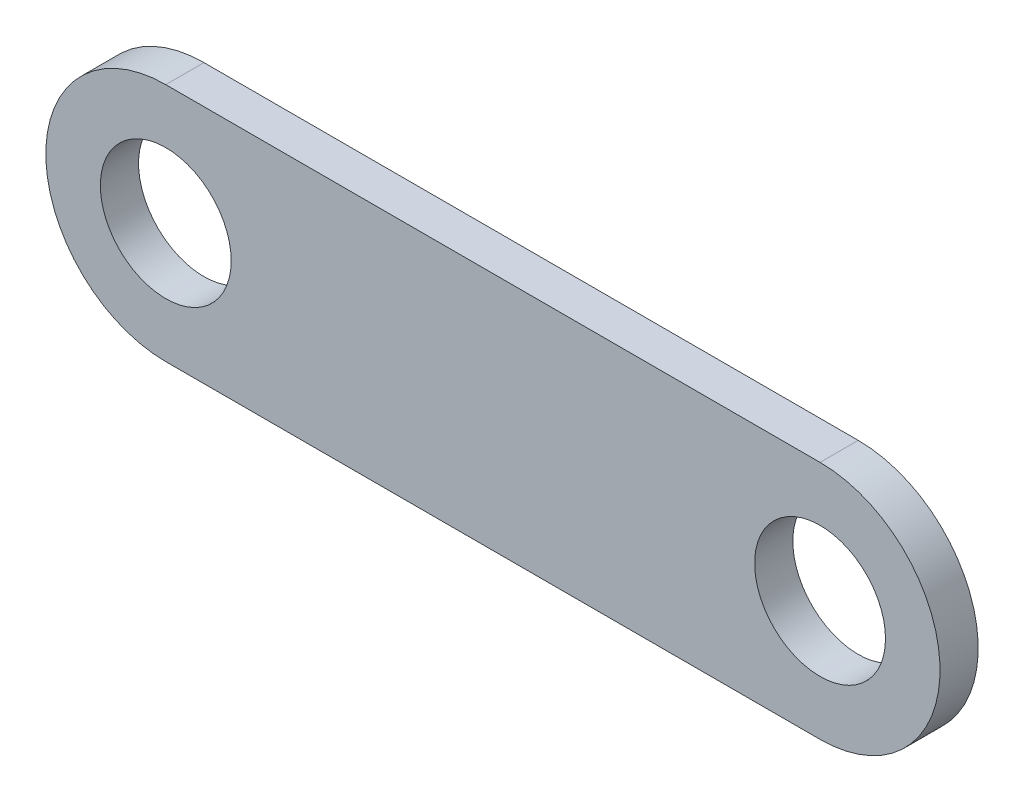
ISO-10303-21;
HEADER;
FILE_DESCRIPTION(('STEP AP214'),'2;1');
FILE_NAME('part.step','',(''),(''),'','','');
FILE_SCHEMA(('AUTOMOTIVE_DESIGN { 1 0 10303 214 1 1 1 1 }'));
ENDSEC;
DATA;
#1=APPLICATION_CONTEXT('core data for automotive mechanical design processes');
#2=APPLICATION_PROTOCOL_DEFINITION('international standard','automotive_design',2000,#1);
#3=PRODUCT_CONTEXT('',#1,'mechanical');
#4=PRODUCT('Part','Part','',(#3));
#5=PRODUCT_RELATED_PRODUCT_CATEGORY('part','',(#4));
#6=PRODUCT_DEFINITION_FORMATION('','',#4);
#7=PRODUCT_DEFINITION_CONTEXT('part definition',#1,'design');
#8=PRODUCT_DEFINITION('design','',#6,#7);
#9=PRODUCT_DEFINITION_SHAPE('','',#8);
#10=(LENGTH_UNIT() NAMED_UNIT(*) SI_UNIT(.MILLI.,.METRE.));
#11=(NAMED_UNIT(*) PLANE_ANGLE_UNIT() SI_UNIT($,.RADIAN.));
#12=(NAMED_UNIT(*) SI_UNIT($,.STERADIAN.) SOLID_ANGLE_UNIT());
#13=UNCERTAINTY_MEASURE_WITH_UNIT(LENGTH_MEASURE(1.E-05),#10,'distance_accuracy_value','');
#14=(GEOMETRIC_REPRESENTATION_CONTEXT(3) GLOBAL_UNCERTAINTY_ASSIGNED_CONTEXT((#13)) GLOBAL_UNIT_ASSIGNED_CONTEXT((#10,
#11,#12)) REPRESENTATION_CONTEXT('',''));
#15=CARTESIAN_POINT('',(0.,0.,0.));
#16=DIRECTION('',(0.,0.,1.));
#17=DIRECTION('',(1.,0.,0.));
#18=AXIS2_PLACEMENT_3D('',#15,#16,#17);
#19=CARTESIAN_POINT('',(30.,0.,3.5));
#20=DIRECTION('',(0.,0.,-1.));
#21=DIRECTION('',(-1.,0.,0.));
#22=AXIS2_PLACEMENT_3D('',#19,#20,#21);
#23=PLANE('',#22);
#24=CARTESIAN_POINT('',(30.,0.,3.5));
#25=DIRECTION('',(0.,0.,1.));
#26=DIRECTION('',(-1.,0.,0.));
#27=AXIS2_PLACEMENT_3D('',#24,#25,#26);
#28=CIRCLE('',#27,11.);
#29=CARTESIAN_POINT('',(30.,-11.,3.5));
#30=VERTEX_POINT('',#29);
#31=CARTESIAN_POINT('',(30.,11.,3.5));
#32=VERTEX_POINT('',#31);
#33=EDGE_CURVE('E87',#30,#32,#28,.T.);
#34=ORIENTED_EDGE('',*,*,#33,.T.);
#35=DIRECTION('',(-1.,0.,0.));
#36=VECTOR('',#35,1.);
#37=CARTESIAN_POINT('',(30.,11.,3.5));
#38=LINE('',#37,#36);
#39=CARTESIAN_POINT('',(-30.,11.,3.5));
#40=VERTEX_POINT('',#39);
#41=EDGE_CURVE('E82',#32,#40,#38,.T.);
#42=ORIENTED_EDGE('',*,*,#41,.T.);
#43=CARTESIAN_POINT('',(-30.,0.,3.5));
#44=DIRECTION('',(0.,0.,1.));
#45=DIRECTION('',(1.,0.,0.));
#46=AXIS2_PLACEMENT_3D('',#43,#44,#45);
#47=CIRCLE('',#46,11.);
#48=CARTESIAN_POINT('',(-30.,-11.,3.5));
#49=VERTEX_POINT('',#48);
#50=EDGE_CURVE('E85',#40,#49,#47,.T.);
#51=ORIENTED_EDGE('',*,*,#50,.T.);
#52=DIRECTION('',(1.,0.,0.));
#53=VECTOR('',#52,1.);
#54=CARTESIAN_POINT('',(30.,-11.,3.5));
#55=LINE('',#54,#53);
#56=EDGE_CURVE('E52',#49,#30,#55,.T.);
#57=ORIENTED_EDGE('',*,*,#56,.T.);
#58=EDGE_LOOP('',(#34,#42,#51,#57));
#59=FACE_BOUND('',#58,.T.);
#60=CARTESIAN_POINT('',(30.,0.,3.5));
#61=DIRECTION('',(0.,0.,1.));
#62=DIRECTION('',(1.,0.,0.));
#63=AXIS2_PLACEMENT_3D('',#60,#61,#62);
#64=CIRCLE('',#63,6.);
#65=CARTESIAN_POINT('',(36.,0.,3.5));
#66=VERTEX_POINT('',#65);
#67=EDGE_CURVE('E102',#66,#66,#64,.T.);
#68=ORIENTED_EDGE('',*,*,#67,.F.);
#69=EDGE_LOOP('',(#68));
#70=FACE_BOUND('',#69,.T.);
#71=CARTESIAN_POINT('',(-30.,0.,3.5));
#72=DIRECTION('',(0.,0.,1.));
#73=DIRECTION('',(1.,0.,0.));
#74=AXIS2_PLACEMENT_3D('',#71,#72,#73);
#75=CIRCLE('',#74,6.);
#76=CARTESIAN_POINT('',(-24.,0.,3.5));
#77=VERTEX_POINT('',#76);
#78=EDGE_CURVE('E117',#77,#77,#75,.T.);
#79=ORIENTED_EDGE('',*,*,#78,.F.);
#80=EDGE_LOOP('',(#79));
#81=FACE_BOUND('',#80,.T.);
#82=ADVANCED_FACE('F35',(#59,#70,#81),#23,.F.);
#83=CARTESIAN_POINT('',(30.,0.,0.));
#84=DIRECTION('',(0.,0.,-1.));
#85=DIRECTION('',(-1.,0.,0.));
#86=AXIS2_PLACEMENT_3D('',#83,#84,#85);
#87=PLANE('',#86);
#88=CARTESIAN_POINT('',(30.,0.,0.));
#89=DIRECTION('',(0.,0.,1.));
#90=DIRECTION('',(1.,0.,0.));
#91=AXIS2_PLACEMENT_3D('',#88,#89,#90);
#92=CIRCLE('',#91,6.);
#93=CARTESIAN_POINT('',(36.,0.,0.));
#94=VERTEX_POINT('',#93);
#95=EDGE_CURVE('E114',#94,#94,#92,.T.);
#96=ORIENTED_EDGE('',*,*,#95,.T.);
#97=EDGE_LOOP('',(#96));
#98=FACE_BOUND('',#97,.T.);
#99=CARTESIAN_POINT('',(30.,0.,0.));
#100=DIRECTION('',(0.,0.,1.));
#101=DIRECTION('',(-1.,0.,0.));
#102=AXIS2_PLACEMENT_3D('',#99,#100,#101);
#103=CIRCLE('',#102,11.);
#104=CARTESIAN_POINT('',(30.,-11.,0.));
#105=VERTEX_POINT('',#104);
#106=CARTESIAN_POINT('',(30.,11.,0.));
#107=VERTEX_POINT('',#106);
#108=EDGE_CURVE('E99',#105,#107,#103,.T.);
#109=ORIENTED_EDGE('',*,*,#108,.F.);
#110=DIRECTION('',(1.,0.,0.));
#111=VECTOR('',#110,1.);
#112=CARTESIAN_POINT('',(30.,-11.,0.));
#113=LINE('',#112,#111);
#114=CARTESIAN_POINT('',(-30.,-11.,0.));
#115=VERTEX_POINT('',#114);
#116=EDGE_CURVE('E75',#115,#105,#113,.T.);
#117=ORIENTED_EDGE('',*,*,#116,.F.);
#118=CARTESIAN_POINT('',(-30.,0.,0.));
#119=DIRECTION('',(0.,0.,1.));
#120=DIRECTION('',(1.,0.,0.));
#121=AXIS2_PLACEMENT_3D('',#118,#119,#120);
#122=CIRCLE('',#121,11.);
#123=CARTESIAN_POINT('',(-30.,11.,0.));
#124=VERTEX_POINT('',#123);
#125=EDGE_CURVE('E69',#124,#115,#122,.T.);
#126=ORIENTED_EDGE('',*,*,#125,.F.);
#127=DIRECTION('',(-1.,0.,0.));
#128=VECTOR('',#127,1.);
#129=CARTESIAN_POINT('',(30.,11.,0.));
#130=LINE('',#129,#128);
#131=EDGE_CURVE('E91',#107,#124,#130,.T.);
#132=ORIENTED_EDGE('',*,*,#131,.F.);
#133=EDGE_LOOP('',(#109,#117,#126,#132));
#134=FACE_BOUND('',#133,.T.);
#135=CARTESIAN_POINT('',(-30.,0.,0.));
#136=DIRECTION('',(0.,0.,1.));
#137=DIRECTION('',(1.,0.,0.));
#138=AXIS2_PLACEMENT_3D('',#135,#136,#137);
#139=CIRCLE('',#138,6.);
#140=CARTESIAN_POINT('',(-24.,0.,0.));
#141=VERTEX_POINT('',#140);
#142=EDGE_CURVE('E120',#141,#141,#139,.T.);
#143=ORIENTED_EDGE('',*,*,#142,.T.);
#144=EDGE_LOOP('',(#143));
#145=FACE_BOUND('',#144,.T.);
#146=ADVANCED_FACE('F110',(#98,#134,#145),#87,.T.);
#147=CARTESIAN_POINT('',(30.,0.,3.5));
#148=DIRECTION('',(0.,0.,-1.));
#149=DIRECTION('',(-1.,0.,0.));
#150=AXIS2_PLACEMENT_3D('',#147,#148,#149);
#151=CYLINDRICAL_SURFACE('',#150,11.);
#152=ORIENTED_EDGE('',*,*,#108,.T.);
#153=DIRECTION('',(0.,0.,-1.));
#154=VECTOR('',#153,1.);
#155=CARTESIAN_POINT('',(30.,11.,3.5));
#156=LINE('',#155,#154);
#157=EDGE_CURVE('E11',#32,#107,#156,.T.);
#158=ORIENTED_EDGE('',*,*,#157,.F.);
#159=ORIENTED_EDGE('',*,*,#33,.F.);
#160=DIRECTION('',(0.,0.,-1.));
#161=VECTOR('',#160,1.);
#162=CARTESIAN_POINT('',(30.,-11.,3.5));
#163=LINE('',#162,#161);
#164=EDGE_CURVE('E95',#30,#105,#163,.T.);
#165=ORIENTED_EDGE('',*,*,#164,.T.);
#166=EDGE_LOOP('',(#152,#158,#159,#165));
#167=FACE_BOUND('',#166,.T.);
#168=ADVANCED_FACE('F37',(#167),#151,.T.);
#169=CARTESIAN_POINT('',(30.,11.,3.5));
#170=DIRECTION('',(0.,-1.,0.));
#171=DIRECTION('',(0.,0.,-1.));
#172=AXIS2_PLACEMENT_3D('',#169,#170,#171);
#173=PLANE('',#172);
#174=ORIENTED_EDGE('',*,*,#131,.T.);
#175=DIRECTION('',(0.,0.,-1.));
#176=VECTOR('',#175,1.);
#177=CARTESIAN_POINT('',(-30.,11.,3.5));
#178=LINE('',#177,#176);
#179=EDGE_CURVE('E44',#40,#124,#178,.T.);
#180=ORIENTED_EDGE('',*,*,#179,.F.);
#181=ORIENTED_EDGE('',*,*,#41,.F.);
#182=ORIENTED_EDGE('',*,*,#157,.T.);
#183=EDGE_LOOP('',(#174,#180,#181,#182));
#184=FACE_BOUND('',#183,.T.);
#185=ADVANCED_FACE('F90',(#184),#173,.F.);
#186=CARTESIAN_POINT('',(-30.,0.,3.5));
#187=DIRECTION('',(0.,0.,-1.));
#188=DIRECTION('',(-1.,0.,0.));
#189=AXIS2_PLACEMENT_3D('',#186,#187,#188);
#190=CYLINDRICAL_SURFACE('',#189,11.);
#191=ORIENTED_EDGE('',*,*,#125,.T.);
#192=DIRECTION('',(0.,0.,-1.));
#193=VECTOR('',#192,1.);
#194=CARTESIAN_POINT('',(-30.,-11.,3.5));
#195=LINE('',#194,#193);
#196=EDGE_CURVE('E92',#49,#115,#195,.T.);
#197=ORIENTED_EDGE('',*,*,#196,.F.);
#198=ORIENTED_EDGE('',*,*,#50,.F.);
#199=ORIENTED_EDGE('',*,*,#179,.T.);
#200=EDGE_LOOP('',(#191,#197,#198,#199));
#201=FACE_BOUND('',#200,.T.);
#202=ADVANCED_FACE('F93',(#201),#190,.T.);
#203=CARTESIAN_POINT('',(30.,-11.,3.5));
#204=DIRECTION('',(0.,1.,0.));
#205=DIRECTION('',(0.,0.,1.));
#206=AXIS2_PLACEMENT_3D('',#203,#204,#205);
#207=PLANE('',#206);
#208=ORIENTED_EDGE('',*,*,#116,.T.);
#209=ORIENTED_EDGE('',*,*,#164,.F.);
#210=ORIENTED_EDGE('',*,*,#56,.F.);
#211=ORIENTED_EDGE('',*,*,#196,.T.);
#212=EDGE_LOOP('',(#208,#209,#210,#211));
#213=FACE_BOUND('',#212,.T.);
#214=ADVANCED_FACE('F107',(#213),#207,.F.);
#215=CARTESIAN_POINT('',(30.,0.,3.5));
#216=DIRECTION('',(0.,0.,-1.));
#217=DIRECTION('',(-1.,0.,0.));
#218=AXIS2_PLACEMENT_3D('',#215,#216,#217);
#219=CYLINDRICAL_SURFACE('',#218,6.);
#220=ORIENTED_EDGE('',*,*,#67,.T.);
#221=EDGE_LOOP('',(#220));
#222=FACE_BOUND('',#221,.T.);
#223=ORIENTED_EDGE('',*,*,#95,.F.);
#224=EDGE_LOOP('',(#223));
#225=FACE_BOUND('',#224,.T.);
#226=ADVANCED_FACE('F137',(#222,#225),#219,.F.);
#227=CARTESIAN_POINT('',(-30.,0.,3.5));
#228=DIRECTION('',(0.,0.,-1.));
#229=DIRECTION('',(-1.,0.,0.));
#230=AXIS2_PLACEMENT_3D('',#227,#228,#229);
#231=CYLINDRICAL_SURFACE('',#230,6.);
#232=ORIENTED_EDGE('',*,*,#78,.T.);
#233=EDGE_LOOP('',(#232));
#234=FACE_BOUND('',#233,.T.);
#235=ORIENTED_EDGE('',*,*,#142,.F.);
#236=EDGE_LOOP('',(#235));
#237=FACE_BOUND('',#236,.T.);
#238=ADVANCED_FACE('F126',(#234,#237),#231,.F.);
#239=CLOSED_SHELL('',(#82,#146,#168,#185,#202,#214,#226,#238));
#240=MANIFOLD_SOLID_BREP('B2',#239);
#241=ADVANCED_BREP_SHAPE_REPRESENTATION('',(#18,#240),#14);
#242=SHAPE_DEFINITION_REPRESENTATION(#9,#241);
ENDSEC;
END-ISO-10303-21;
